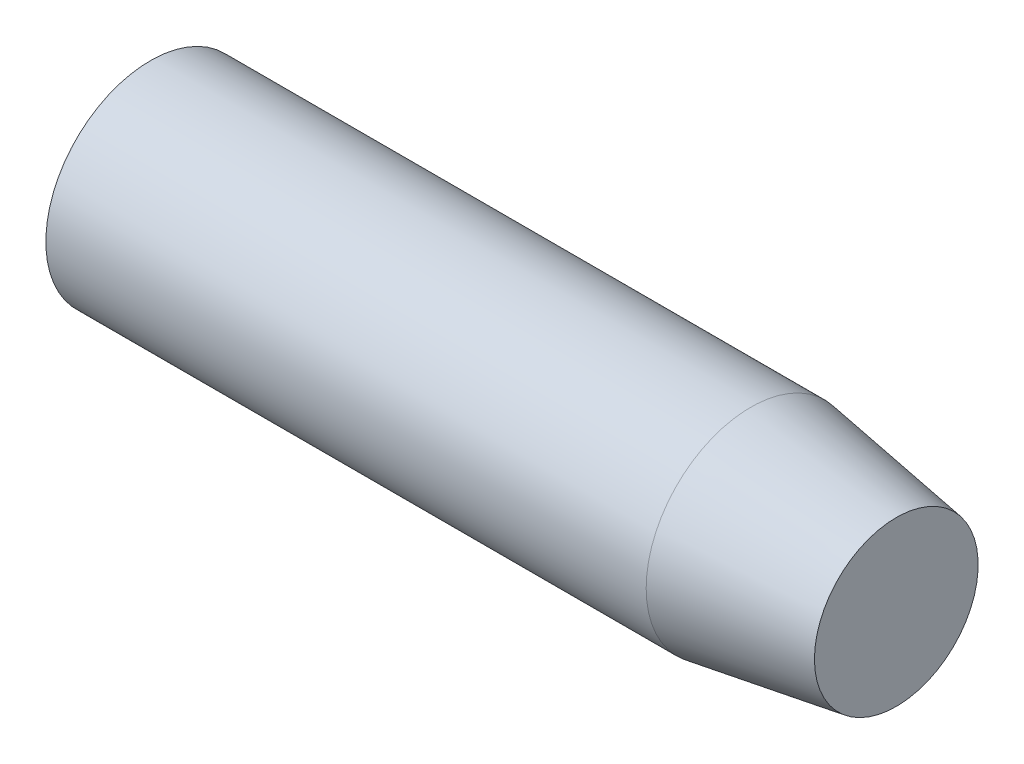
ISO-10303-21;
HEADER;
FILE_DESCRIPTION(('STEP AP214'),'2;1');
FILE_NAME('part.step','',(''),(''),'','','');
FILE_SCHEMA(('AUTOMOTIVE_DESIGN { 1 0 10303 214 1 1 1 1 }'));
ENDSEC;
DATA;
#1=APPLICATION_CONTEXT('core data for automotive mechanical design processes');
#2=APPLICATION_PROTOCOL_DEFINITION('international standard','automotive_design',2000,#1);
#3=PRODUCT_CONTEXT('',#1,'mechanical');
#4=PRODUCT('Part','Part','',(#3));
#5=PRODUCT_RELATED_PRODUCT_CATEGORY('part','',(#4));
#6=PRODUCT_DEFINITION_FORMATION('','',#4);
#7=PRODUCT_DEFINITION_CONTEXT('part definition',#1,'design');
#8=PRODUCT_DEFINITION('design','',#6,#7);
#9=PRODUCT_DEFINITION_SHAPE('','',#8);
#10=(LENGTH_UNIT() NAMED_UNIT(*) SI_UNIT(.MILLI.,.METRE.));
#11=(NAMED_UNIT(*) PLANE_ANGLE_UNIT() SI_UNIT($,.RADIAN.));
#12=(NAMED_UNIT(*) SI_UNIT($,.STERADIAN.) SOLID_ANGLE_UNIT());
#13=UNCERTAINTY_MEASURE_WITH_UNIT(LENGTH_MEASURE(1.E-05),#10,'distance_accuracy_value','');
#14=(GEOMETRIC_REPRESENTATION_CONTEXT(3) GLOBAL_UNCERTAINTY_ASSIGNED_CONTEXT((#13)) GLOBAL_UNIT_ASSIGNED_CONTEXT((#10,
#11,#12)) REPRESENTATION_CONTEXT('',''));
#15=CARTESIAN_POINT('',(0.,0.,0.));
#16=DIRECTION('',(0.,0.,1.));
#17=DIRECTION('',(1.,0.,0.));
#18=AXIS2_PLACEMENT_3D('',#15,#16,#17);
#19=CARTESIAN_POINT('',(130.175,0.,0.));
#20=DIRECTION('',(1.,0.,0.));
#21=DIRECTION('',(0.,0.,-1.));
#22=AXIS2_PLACEMENT_3D('',#19,#20,#21);
#23=PLANE('',#22);
#24=CARTESIAN_POINT('',(130.175,0.,0.));
#25=DIRECTION('',(-1.,0.,0.));
#26=DIRECTION('',(0.,0.,1.));
#27=AXIS2_PLACEMENT_3D('',#24,#25,#26);
#28=CIRCLE('',#27,14.2875000000014);
#29=CARTESIAN_POINT('',(130.175,0.,14.2875000000014));
#30=VERTEX_POINT('',#29);
#31=EDGE_CURVE('E17',#30,#30,#28,.T.);
#32=ORIENTED_EDGE('',*,*,#31,.F.);
#33=EDGE_LOOP('',(#32));
#34=FACE_BOUND('',#33,.T.);
#35=ADVANCED_FACE('F14',(#34),#23,.T.);
#36=CARTESIAN_POINT('',(0.,0.,0.));
#37=DIRECTION('',(1.,0.,0.));
#38=DIRECTION('',(0.,0.,-1.));
#39=AXIS2_PLACEMENT_3D('',#36,#37,#38);
#40=PLANE('',#39);
#41=CARTESIAN_POINT('',(0.,0.,0.));
#42=DIRECTION('',(1.,0.,0.));
#43=DIRECTION('',(0.,0.,-1.));
#44=AXIS2_PLACEMENT_3D('',#41,#42,#43);
#45=CIRCLE('',#44,18.25625);
#46=CARTESIAN_POINT('',(0.,0.,-18.25625));
#47=VERTEX_POINT('',#46);
#48=EDGE_CURVE('E21',#47,#47,#45,.T.);
#49=ORIENTED_EDGE('',*,*,#48,.F.);
#50=EDGE_LOOP('',(#49));
#51=FACE_BOUND('',#50,.T.);
#52=ADVANCED_FACE('F34',(#51),#40,.F.);
#53=CARTESIAN_POINT('',(104.775,0.,0.));
#54=DIRECTION('',(-1.,0.,0.));
#55=DIRECTION('',(0.,0.,1.));
#56=AXIS2_PLACEMENT_3D('',#53,#54,#55);
#57=CONICAL_SURFACE('',#56,18.2562500000005,0.154996741923907);
#58=CARTESIAN_POINT('',(104.775,0.,0.));
#59=DIRECTION('',(1.,0.,0.));
#60=DIRECTION('',(0.,0.,-1.));
#61=AXIS2_PLACEMENT_3D('',#58,#59,#60);
#62=CIRCLE('',#61,18.25625);
#63=CARTESIAN_POINT('',(104.775,0.,-18.25625));
#64=VERTEX_POINT('',#63);
#65=EDGE_CURVE('E10',#64,#64,#62,.F.);
#66=ORIENTED_EDGE('',*,*,#65,.F.);
#67=EDGE_LOOP('',(#66));
#68=FACE_BOUND('',#67,.T.);
#69=ORIENTED_EDGE('',*,*,#31,.T.);
#70=EDGE_LOOP('',(#69));
#71=FACE_BOUND('',#70,.T.);
#72=ADVANCED_FACE('F31',(#68,#71),#57,.T.);
#73=CARTESIAN_POINT('',(0.,0.,0.));
#74=DIRECTION('',(1.,0.,0.));
#75=DIRECTION('',(0.,0.,-1.));
#76=AXIS2_PLACEMENT_3D('',#73,#74,#75);
#77=CYLINDRICAL_SURFACE('',#76,18.25625);
#78=ORIENTED_EDGE('',*,*,#48,.T.);
#79=EDGE_LOOP('',(#78));
#80=FACE_BOUND('',#79,.T.);
#81=ORIENTED_EDGE('',*,*,#65,.T.);
#82=EDGE_LOOP('',(#81));
#83=FACE_BOUND('',#82,.T.);
#84=ADVANCED_FACE('F40',(#80,#83),#77,.T.);
#85=CLOSED_SHELL('',(#35,#52,#72,#84));
#86=MANIFOLD_SOLID_BREP('B1',#85);
#87=ADVANCED_BREP_SHAPE_REPRESENTATION('',(#18,#86),#14);
#88=SHAPE_DEFINITION_REPRESENTATION(#9,#87);
ENDSEC;
END-ISO-10303-21;
